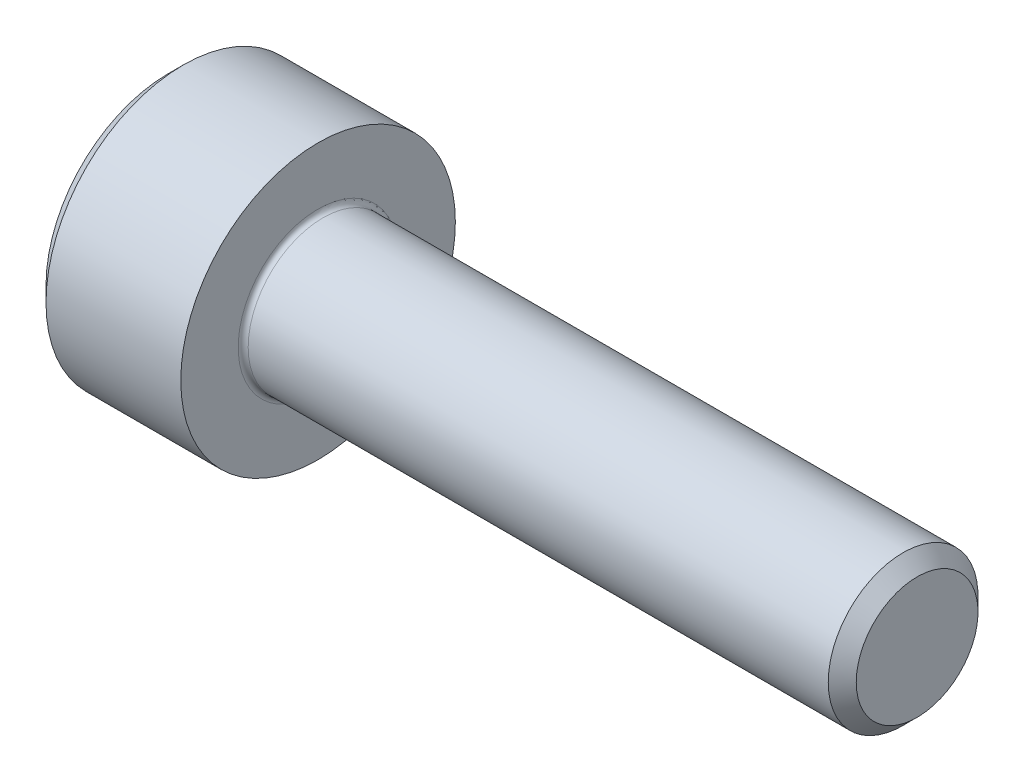
ISO-10303-21;
HEADER;
FILE_DESCRIPTION(('STEP AP214'),'2;1');
FILE_NAME('part.step','',(''),(''),'','','');
FILE_SCHEMA(('AUTOMOTIVE_DESIGN { 1 0 10303 214 1 1 1 1 }'));
ENDSEC;
DATA;
#1=APPLICATION_CONTEXT('core data for automotive mechanical design processes');
#2=APPLICATION_PROTOCOL_DEFINITION('international standard','automotive_design',2000,#1);
#3=PRODUCT_CONTEXT('',#1,'mechanical');
#4=PRODUCT('Part','Part','',(#3));
#5=PRODUCT_RELATED_PRODUCT_CATEGORY('part','',(#4));
#6=PRODUCT_DEFINITION_FORMATION('','',#4);
#7=PRODUCT_DEFINITION_CONTEXT('part definition',#1,'design');
#8=PRODUCT_DEFINITION('design','',#6,#7);
#9=PRODUCT_DEFINITION_SHAPE('','',#8);
#10=(LENGTH_UNIT() NAMED_UNIT(*) SI_UNIT(.MILLI.,.METRE.));
#11=(NAMED_UNIT(*) PLANE_ANGLE_UNIT() SI_UNIT($,.RADIAN.));
#12=(NAMED_UNIT(*) SI_UNIT($,.STERADIAN.) SOLID_ANGLE_UNIT());
#13=UNCERTAINTY_MEASURE_WITH_UNIT(LENGTH_MEASURE(1.E-05),#10,'distance_accuracy_value','');
#14=(GEOMETRIC_REPRESENTATION_CONTEXT(3) GLOBAL_UNCERTAINTY_ASSIGNED_CONTEXT((#13)) GLOBAL_UNIT_ASSIGNED_CONTEXT((#10,
#11,#12)) REPRESENTATION_CONTEXT('',''));
#15=CARTESIAN_POINT('',(0.,0.,0.));
#16=DIRECTION('',(0.,0.,1.));
#17=DIRECTION('',(1.,0.,0.));
#18=AXIS2_PLACEMENT_3D('',#15,#16,#17);
#19=CARTESIAN_POINT('',(0.,0.,0.));
#20=DIRECTION('',(-1.,0.,0.));
#21=DIRECTION('',(0.,0.,1.));
#22=AXIS2_PLACEMENT_3D('',#19,#20,#21);
#23=PLANE('',#22);
#24=DIRECTION('',(0.,-0.5,0.86602540378444));
#25=VECTOR('',#24,1.);
#26=CARTESIAN_POINT('',(0.,1.47801668912544,0.));
#27=LINE('',#26,#25);
#28=CARTESIAN_POINT('',(0.,1.47801668912544,0.));
#29=VERTEX_POINT('',#28);
#30=CARTESIAN_POINT('',(0.,0.73900834456272,1.28));
#31=VERTEX_POINT('',#30);
#32=EDGE_CURVE('E377',#29,#31,#27,.T.);
#33=ORIENTED_EDGE('',*,*,#32,.T.);
#34=DIRECTION('',(0.,1.,0.));
#35=VECTOR('',#34,1.);
#36=CARTESIAN_POINT('',(0.,-0.739008344562722,1.28));
#37=LINE('',#36,#35);
#38=CARTESIAN_POINT('',(0.,-0.739008344562722,1.28));
#39=VERTEX_POINT('',#38);
#40=EDGE_CURVE('E109',#39,#31,#37,.T.);
#41=ORIENTED_EDGE('',*,*,#40,.F.);
#42=DIRECTION('',(0.,-0.5,-0.866025403784438));
#43=VECTOR('',#42,1.);
#44=CARTESIAN_POINT('',(0.,-0.739008344562722,1.28));
#45=LINE('',#44,#43);
#46=CARTESIAN_POINT('',(0.,-1.47801668912544,0.));
#47=VERTEX_POINT('',#46);
#48=EDGE_CURVE('E380',#39,#47,#45,.T.);
#49=ORIENTED_EDGE('',*,*,#48,.T.);
#50=DIRECTION('',(0.,0.5,-0.86602540378444));
#51=VECTOR('',#50,1.);
#52=CARTESIAN_POINT('',(0.,-1.47801668912544,0.));
#53=LINE('',#52,#51);
#54=CARTESIAN_POINT('',(0.,-0.739008344562726,-1.28));
#55=VERTEX_POINT('',#54);
#56=EDGE_CURVE('E383',#47,#55,#53,.T.);
#57=ORIENTED_EDGE('',*,*,#56,.T.);
#58=DIRECTION('',(0.,-1.,0.));
#59=VECTOR('',#58,1.);
#60=CARTESIAN_POINT('',(0.,0.739008344562716,-1.28));
#61=LINE('',#60,#59);
#62=CARTESIAN_POINT('',(0.,0.739008344562716,-1.28));
#63=VERTEX_POINT('',#62);
#64=EDGE_CURVE('E386',#63,#55,#61,.T.);
#65=ORIENTED_EDGE('',*,*,#64,.F.);
#66=DIRECTION('',(0.,-0.5,-0.866025403784438));
#67=VECTOR('',#66,1.);
#68=CARTESIAN_POINT('',(0.,1.47801668912544,0.));
#69=LINE('',#68,#67);
#70=EDGE_CURVE('E104',#29,#63,#69,.T.);
#71=ORIENTED_EDGE('',*,*,#70,.F.);
#72=EDGE_LOOP('',(#33,#41,#49,#57,#65,#71));
#73=FACE_BOUND('',#72,.T.);
#74=CARTESIAN_POINT('',(0.,0.,0.));
#75=DIRECTION('',(-1.,0.,0.));
#76=DIRECTION('',(0.,0.,1.));
#77=AXIS2_PLACEMENT_3D('',#74,#75,#76);
#78=CIRCLE('',#77,2.45);
#79=CARTESIAN_POINT('',(0.,0.,2.45));
#80=VERTEX_POINT('',#79);
#81=EDGE_CURVE('E120',#80,#80,#78,.T.);
#82=ORIENTED_EDGE('',*,*,#81,.T.);
#83=EDGE_LOOP('',(#82));
#84=FACE_BOUND('',#83,.T.);
#85=ADVANCED_FACE('F17',(#73,#84),#23,.T.);
#86=CARTESIAN_POINT('',(15.,1.2195,0.));
#87=DIRECTION('',(1.,0.,0.));
#88=DIRECTION('',(0.,0.,-1.));
#89=AXIS2_PLACEMENT_3D('',#86,#87,#88);
#90=PLANE('',#89);
#91=CARTESIAN_POINT('',(15.,0.,0.));
#92=DIRECTION('',(-1.,0.,0.));
#93=DIRECTION('',(0.,0.,1.));
#94=AXIS2_PLACEMENT_3D('',#91,#92,#93);
#95=CIRCLE('',#94,1.2195);
#96=CARTESIAN_POINT('',(15.,0.,1.2195));
#97=VERTEX_POINT('',#96);
#98=EDGE_CURVE('E133',#97,#97,#95,.T.);
#99=ORIENTED_EDGE('',*,*,#98,.F.);
#100=EDGE_LOOP('',(#99));
#101=FACE_BOUND('',#100,.T.);
#102=ADVANCED_FACE('F155',(#101),#90,.T.);
#103=CARTESIAN_POINT('',(15.,0.,0.));
#104=DIRECTION('',(-1.,0.,0.));
#105=DIRECTION('',(0.,0.,1.));
#106=AXIS2_PLACEMENT_3D('',#103,#104,#105);
#107=CONICAL_SURFACE('',#106,1.2195,0.785398163397391);
#108=CARTESIAN_POINT('',(14.7195,0.,0.));
#109=DIRECTION('',(-1.,0.,0.));
#110=DIRECTION('',(0.,0.,1.));
#111=AXIS2_PLACEMENT_3D('',#108,#109,#110);
#112=CIRCLE('',#111,1.49999999999998);
#113=CARTESIAN_POINT('',(14.7195,0.,1.49999999999998));
#114=VERTEX_POINT('',#113);
#115=EDGE_CURVE('E130',#114,#114,#112,.T.);
#116=ORIENTED_EDGE('',*,*,#115,.F.);
#117=EDGE_LOOP('',(#116));
#118=FACE_BOUND('',#117,.T.);
#119=ORIENTED_EDGE('',*,*,#98,.T.);
#120=EDGE_LOOP('',(#119));
#121=FACE_BOUND('',#120,.T.);
#122=ADVANCED_FACE('F161',(#118,#121),#107,.T.);
#123=CARTESIAN_POINT('',(-31.75,0.,0.));
#124=DIRECTION('',(-1.,0.,0.));
#125=DIRECTION('',(0.,0.,1.));
#126=AXIS2_PLACEMENT_3D('',#123,#124,#125);
#127=CYLINDRICAL_SURFACE('',#126,1.5);
#128=CARTESIAN_POINT('',(3.1,0.,0.));
#129=DIRECTION('',(1.,0.,0.));
#130=DIRECTION('',(0.,0.,-1.));
#131=AXIS2_PLACEMENT_3D('',#128,#129,#130);
#132=CIRCLE('',#131,1.5);
#133=CARTESIAN_POINT('',(3.1,0.,-1.5));
#134=VERTEX_POINT('',#133);
#135=EDGE_CURVE('E11',#134,#134,#132,.T.);
#136=ORIENTED_EDGE('',*,*,#135,.T.);
#137=EDGE_LOOP('',(#136));
#138=FACE_BOUND('',#137,.T.);
#139=ORIENTED_EDGE('',*,*,#115,.T.);
#140=EDGE_LOOP('',(#139));
#141=FACE_BOUND('',#140,.T.);
#142=ADVANCED_FACE('F172',(#138,#141),#127,.T.);
#143=CARTESIAN_POINT('',(3.,2.75,0.));
#144=DIRECTION('',(1.,0.,0.));
#145=DIRECTION('',(0.,0.,-1.));
#146=AXIS2_PLACEMENT_3D('',#143,#144,#145);
#147=PLANE('',#146);
#148=CARTESIAN_POINT('',(3.,0.,0.));
#149=DIRECTION('',(1.,0.,0.));
#150=DIRECTION('',(0.,0.,-1.));
#151=AXIS2_PLACEMENT_3D('',#148,#149,#150);
#152=CIRCLE('',#151,1.6);
#153=CARTESIAN_POINT('',(3.,0.,-1.6));
#154=VERTEX_POINT('',#153);
#155=EDGE_CURVE('E25',#154,#154,#152,.F.);
#156=ORIENTED_EDGE('',*,*,#155,.T.);
#157=EDGE_LOOP('',(#156));
#158=FACE_BOUND('',#157,.T.);
#159=CARTESIAN_POINT('',(3.,0.,0.));
#160=DIRECTION('',(-1.,0.,0.));
#161=DIRECTION('',(0.,0.,1.));
#162=AXIS2_PLACEMENT_3D('',#159,#160,#161);
#163=CIRCLE('',#162,2.75);
#164=CARTESIAN_POINT('',(3.,0.,2.75));
#165=VERTEX_POINT('',#164);
#166=EDGE_CURVE('E127',#165,#165,#163,.T.);
#167=ORIENTED_EDGE('',*,*,#166,.F.);
#168=EDGE_LOOP('',(#167));
#169=FACE_BOUND('',#168,.T.);
#170=ADVANCED_FACE('F138',(#158,#169),#147,.T.);
#171=CARTESIAN_POINT('',(-31.75,0.,0.));
#172=DIRECTION('',(-1.,0.,0.));
#173=DIRECTION('',(0.,0.,1.));
#174=AXIS2_PLACEMENT_3D('',#171,#172,#173);
#175=CYLINDRICAL_SURFACE('',#174,2.75);
#176=ORIENTED_EDGE('',*,*,#166,.T.);
#177=EDGE_LOOP('',(#176));
#178=FACE_BOUND('',#177,.T.);
#179=CARTESIAN_POINT('',(0.3,0.,0.));
#180=DIRECTION('',(-1.,0.,0.));
#181=DIRECTION('',(0.,0.,1.));
#182=AXIS2_PLACEMENT_3D('',#179,#180,#181);
#183=CIRCLE('',#182,2.75);
#184=CARTESIAN_POINT('',(0.3,0.,2.75));
#185=VERTEX_POINT('',#184);
#186=EDGE_CURVE('E124',#185,#185,#183,.T.);
#187=ORIENTED_EDGE('',*,*,#186,.F.);
#188=EDGE_LOOP('',(#187));
#189=FACE_BOUND('',#188,.T.);
#190=ADVANCED_FACE('F150',(#178,#189),#175,.T.);
#191=CARTESIAN_POINT('',(0.,0.,0.));
#192=DIRECTION('',(1.,0.,0.));
#193=DIRECTION('',(0.,0.,-1.));
#194=AXIS2_PLACEMENT_3D('',#191,#192,#193);
#195=CONICAL_SURFACE('',#194,2.45,0.785398163397439);
#196=ORIENTED_EDGE('',*,*,#186,.T.);
#197=EDGE_LOOP('',(#196));
#198=FACE_BOUND('',#197,.T.);
#199=ORIENTED_EDGE('',*,*,#81,.F.);
#200=EDGE_LOOP('',(#199));
#201=FACE_BOUND('',#200,.T.);
#202=ADVANCED_FACE('F142',(#198,#201),#195,.T.);
#203=CARTESIAN_POINT('',(3.1,0.,0.));
#204=DIRECTION('',(1.,0.,0.));
#205=DIRECTION('',(0.,0.,-1.));
#206=AXIS2_PLACEMENT_3D('',#203,#204,#205);
#207=TOROIDAL_SURFACE('',#206,1.6,0.1);
#208=ORIENTED_EDGE('',*,*,#135,.F.);
#209=EDGE_LOOP('',(#208));
#210=FACE_BOUND('',#209,.T.);
#211=ORIENTED_EDGE('',*,*,#155,.F.);
#212=EDGE_LOOP('',(#211));
#213=FACE_BOUND('',#212,.T.);
#214=ADVANCED_FACE('F19',(#210,#213),#207,.F.);
#215=CARTESIAN_POINT('',(1.3,1.47801668912544,0.));
#216=DIRECTION('',(0.,-0.86602540378444,-0.5));
#217=DIRECTION('',(0.,0.5,-0.86602540378444));
#218=AXIS2_PLACEMENT_3D('',#215,#216,#217);
#219=PLANE('',#218);
#220=ORIENTED_EDGE('',*,*,#32,.F.);
#221=DIRECTION('',(-1.,0.,0.));
#222=VECTOR('',#221,1.);
#223=CARTESIAN_POINT('',(1.3,1.47801668912544,0.));
#224=LINE('',#223,#222);
#225=CARTESIAN_POINT('',(1.3,1.47801668912544,0.));
#226=VERTEX_POINT('',#225);
#227=EDGE_CURVE('E376',#226,#29,#224,.T.);
#228=ORIENTED_EDGE('',*,*,#227,.F.);
#229=DIRECTION('',(0.,-0.5,0.86602540378444));
#230=VECTOR('',#229,1.);
#231=CARTESIAN_POINT('',(1.3,1.47801668912544,0.));
#232=LINE('',#231,#230);
#233=CARTESIAN_POINT('',(1.3,1.10851251684408,0.64));
#234=VERTEX_POINT('',#233);
#235=EDGE_CURVE('E32',#226,#234,#232,.T.);
#236=ORIENTED_EDGE('',*,*,#235,.T.);
#237=CARTESIAN_POINT('',(1.3,0.73900834456272,1.28));
#238=VERTEX_POINT('',#237);
#239=EDGE_CURVE('E90',#234,#238,#232,.T.);
#240=ORIENTED_EDGE('',*,*,#239,.T.);
#241=DIRECTION('',(-1.,0.,0.));
#242=VECTOR('',#241,1.);
#243=CARTESIAN_POINT('',(1.3,0.73900834456272,1.28));
#244=LINE('',#243,#242);
#245=EDGE_CURVE('E102',#238,#31,#244,.T.);
#246=ORIENTED_EDGE('',*,*,#245,.T.);
#247=EDGE_LOOP('',(#220,#228,#236,#240,#246));
#248=FACE_BOUND('',#247,.T.);
#249=ADVANCED_FACE('F101',(#248),#219,.T.);
#250=CARTESIAN_POINT('',(1.3,-0.739008344562722,1.28));
#251=DIRECTION('',(0.,0.,1.));
#252=DIRECTION('',(0.,-1.,0.));
#253=AXIS2_PLACEMENT_3D('',#250,#251,#252);
#254=PLANE('',#253);
#255=ORIENTED_EDGE('',*,*,#40,.T.);
#256=ORIENTED_EDGE('',*,*,#245,.F.);
#257=DIRECTION('',(0.,1.,0.));
#258=VECTOR('',#257,1.);
#259=CARTESIAN_POINT('',(1.3,-0.739008344562722,1.28));
#260=LINE('',#259,#258);
#261=CARTESIAN_POINT('',(1.3,0.,1.28));
#262=VERTEX_POINT('',#261);
#263=EDGE_CURVE('E88',#262,#238,#260,.T.);
#264=ORIENTED_EDGE('',*,*,#263,.F.);
#265=CARTESIAN_POINT('',(1.3,-0.739008344562722,1.28));
#266=VERTEX_POINT('',#265);
#267=EDGE_CURVE('E98',#266,#262,#260,.T.);
#268=ORIENTED_EDGE('',*,*,#267,.F.);
#269=DIRECTION('',(-1.,0.,0.));
#270=VECTOR('',#269,1.);
#271=CARTESIAN_POINT('',(1.3,-0.739008344562722,1.28));
#272=LINE('',#271,#270);
#273=EDGE_CURVE('E111',#266,#39,#272,.T.);
#274=ORIENTED_EDGE('',*,*,#273,.T.);
#275=EDGE_LOOP('',(#255,#256,#264,#268,#274));
#276=FACE_BOUND('',#275,.T.);
#277=ADVANCED_FACE('F106',(#276),#254,.F.);
#278=CARTESIAN_POINT('',(1.3,-0.739008344562722,1.28));
#279=DIRECTION('',(0.,0.866025403784438,-0.5));
#280=DIRECTION('',(0.,0.5,0.866025403784438));
#281=AXIS2_PLACEMENT_3D('',#278,#279,#280);
#282=PLANE('',#281);
#283=ORIENTED_EDGE('',*,*,#48,.F.);
#284=ORIENTED_EDGE('',*,*,#273,.F.);
#285=DIRECTION('',(0.,-0.5,-0.866025403784438));
#286=VECTOR('',#285,1.);
#287=CARTESIAN_POINT('',(1.3,-0.739008344562722,1.28));
#288=LINE('',#287,#286);
#289=CARTESIAN_POINT('',(1.3,-1.10851251684408,0.64));
#290=VERTEX_POINT('',#289);
#291=EDGE_CURVE('E355',#266,#290,#288,.T.);
#292=ORIENTED_EDGE('',*,*,#291,.T.);
#293=CARTESIAN_POINT('',(1.3,-1.47801668912544,0.));
#294=VERTEX_POINT('',#293);
#295=EDGE_CURVE('E357',#290,#294,#288,.T.);
#296=ORIENTED_EDGE('',*,*,#295,.T.);
#297=DIRECTION('',(-1.,0.,0.));
#298=VECTOR('',#297,1.);
#299=CARTESIAN_POINT('',(1.3,-1.47801668912544,0.));
#300=LINE('',#299,#298);
#301=EDGE_CURVE('E116',#294,#47,#300,.T.);
#302=ORIENTED_EDGE('',*,*,#301,.T.);
#303=EDGE_LOOP('',(#283,#284,#292,#296,#302));
#304=FACE_BOUND('',#303,.T.);
#305=ADVANCED_FACE('F232',(#304),#282,.T.);
#306=CARTESIAN_POINT('',(1.3,-1.47801668912544,0.));
#307=DIRECTION('',(0.,0.86602540378444,0.5));
#308=DIRECTION('',(0.,-0.5,0.86602540378444));
#309=AXIS2_PLACEMENT_3D('',#306,#307,#308);
#310=PLANE('',#309);
#311=ORIENTED_EDGE('',*,*,#56,.F.);
#312=ORIENTED_EDGE('',*,*,#301,.F.);
#313=DIRECTION('',(0.,0.5,-0.86602540378444));
#314=VECTOR('',#313,1.);
#315=CARTESIAN_POINT('',(1.3,-1.47801668912544,0.));
#316=LINE('',#315,#314);
#317=CARTESIAN_POINT('',(1.3,-1.10851251684409,-0.64));
#318=VERTEX_POINT('',#317);
#319=EDGE_CURVE('E360',#294,#318,#316,.T.);
#320=ORIENTED_EDGE('',*,*,#319,.T.);
#321=CARTESIAN_POINT('',(1.3,-0.739008344562726,-1.28));
#322=VERTEX_POINT('',#321);
#323=EDGE_CURVE('E364',#318,#322,#316,.T.);
#324=ORIENTED_EDGE('',*,*,#323,.T.);
#325=DIRECTION('',(-1.,0.,0.));
#326=VECTOR('',#325,1.);
#327=CARTESIAN_POINT('',(1.3,-0.739008344562726,-1.28));
#328=LINE('',#327,#326);
#329=EDGE_CURVE('E395',#322,#55,#328,.T.);
#330=ORIENTED_EDGE('',*,*,#329,.T.);
#331=EDGE_LOOP('',(#311,#312,#320,#324,#330));
#332=FACE_BOUND('',#331,.T.);
#333=ADVANCED_FACE('F242',(#332),#310,.T.);
#334=CARTESIAN_POINT('',(1.3,0.739008344562716,-1.28));
#335=DIRECTION('',(0.,0.,-1.));
#336=DIRECTION('',(0.,1.,0.));
#337=AXIS2_PLACEMENT_3D('',#334,#335,#336);
#338=PLANE('',#337);
#339=ORIENTED_EDGE('',*,*,#64,.T.);
#340=ORIENTED_EDGE('',*,*,#329,.F.);
#341=DIRECTION('',(0.,-1.,0.));
#342=VECTOR('',#341,1.);
#343=CARTESIAN_POINT('',(1.3,0.739008344562716,-1.28));
#344=LINE('',#343,#342);
#345=CARTESIAN_POINT('',(1.3,0.,-1.28));
#346=VERTEX_POINT('',#345);
#347=EDGE_CURVE('E368',#346,#322,#344,.T.);
#348=ORIENTED_EDGE('',*,*,#347,.F.);
#349=CARTESIAN_POINT('',(1.3,0.739008344562716,-1.28));
#350=VERTEX_POINT('',#349);
#351=EDGE_CURVE('E369',#350,#346,#344,.T.);
#352=ORIENTED_EDGE('',*,*,#351,.F.);
#353=DIRECTION('',(-1.,0.,0.));
#354=VECTOR('',#353,1.);
#355=CARTESIAN_POINT('',(1.3,0.739008344562716,-1.28));
#356=LINE('',#355,#354);
#357=EDGE_CURVE('E392',#350,#63,#356,.T.);
#358=ORIENTED_EDGE('',*,*,#357,.T.);
#359=EDGE_LOOP('',(#339,#340,#348,#352,#358));
#360=FACE_BOUND('',#359,.T.);
#361=ADVANCED_FACE('F252',(#360),#338,.F.);
#362=CARTESIAN_POINT('',(1.3,1.47801668912544,0.));
#363=DIRECTION('',(0.,0.866025403784438,-0.5));
#364=DIRECTION('',(0.,0.5,0.866025403784438));
#365=AXIS2_PLACEMENT_3D('',#362,#363,#364);
#366=PLANE('',#365);
#367=ORIENTED_EDGE('',*,*,#70,.T.);
#368=ORIENTED_EDGE('',*,*,#357,.F.);
#369=DIRECTION('',(0.,-0.5,-0.866025403784438));
#370=VECTOR('',#369,1.);
#371=CARTESIAN_POINT('',(1.3,1.47801668912544,0.));
#372=LINE('',#371,#370);
#373=CARTESIAN_POINT('',(1.3,1.10851251684408,-0.64));
#374=VERTEX_POINT('',#373);
#375=EDGE_CURVE('E372',#374,#350,#372,.T.);
#376=ORIENTED_EDGE('',*,*,#375,.F.);
#377=EDGE_CURVE('E373',#226,#374,#372,.T.);
#378=ORIENTED_EDGE('',*,*,#377,.F.);
#379=ORIENTED_EDGE('',*,*,#227,.T.);
#380=EDGE_LOOP('',(#367,#368,#376,#378,#379));
#381=FACE_BOUND('',#380,.T.);
#382=ADVANCED_FACE('F262',(#381),#366,.F.);
#383=CARTESIAN_POINT('',(1.3,0.73900834456272,1.28));
#384=DIRECTION('',(-1.,0.,0.));
#385=DIRECTION('',(0.,0.,1.));
#386=AXIS2_PLACEMENT_3D('',#383,#384,#385);
#387=PLANE('',#386);
#388=CARTESIAN_POINT('',(1.3,0.,0.));
#389=DIRECTION('',(-1.,0.,0.));
#390=DIRECTION('',(0.,0.,1.));
#391=AXIS2_PLACEMENT_3D('',#388,#389,#390);
#392=CIRCLE('',#391,1.28);
#393=EDGE_CURVE('E110',#290,#262,#392,.T.);
#394=ORIENTED_EDGE('',*,*,#393,.F.);
#395=ORIENTED_EDGE('',*,*,#291,.F.);
#396=ORIENTED_EDGE('',*,*,#267,.T.);
#397=EDGE_LOOP('',(#394,#395,#396));
#398=FACE_BOUND('',#397,.T.);
#399=ADVANCED_FACE('F272',(#398),#387,.T.);
#400=EDGE_CURVE('E114',#318,#290,#392,.T.);
#401=ORIENTED_EDGE('',*,*,#400,.F.);
#402=ORIENTED_EDGE('',*,*,#319,.F.);
#403=ORIENTED_EDGE('',*,*,#295,.F.);
#404=EDGE_LOOP('',(#401,#402,#403));
#405=FACE_BOUND('',#404,.T.);
#406=ADVANCED_FACE('F282',(#405),#387,.T.);
#407=EDGE_CURVE('E403',#346,#318,#392,.T.);
#408=ORIENTED_EDGE('',*,*,#407,.F.);
#409=ORIENTED_EDGE('',*,*,#347,.T.);
#410=ORIENTED_EDGE('',*,*,#323,.F.);
#411=EDGE_LOOP('',(#408,#409,#410));
#412=FACE_BOUND('',#411,.T.);
#413=ADVANCED_FACE('F292',(#412),#387,.T.);
#414=EDGE_CURVE('E402',#374,#346,#392,.T.);
#415=ORIENTED_EDGE('',*,*,#414,.F.);
#416=ORIENTED_EDGE('',*,*,#375,.T.);
#417=ORIENTED_EDGE('',*,*,#351,.T.);
#418=EDGE_LOOP('',(#415,#416,#417));
#419=FACE_BOUND('',#418,.T.);
#420=ADVANCED_FACE('F301',(#419),#387,.T.);
#421=EDGE_CURVE('E121',#234,#374,#392,.T.);
#422=ORIENTED_EDGE('',*,*,#421,.F.);
#423=ORIENTED_EDGE('',*,*,#235,.F.);
#424=ORIENTED_EDGE('',*,*,#377,.T.);
#425=EDGE_LOOP('',(#422,#423,#424));
#426=FACE_BOUND('',#425,.T.);
#427=ADVANCED_FACE('F310',(#426),#387,.T.);
#428=EDGE_CURVE('E93',#262,#234,#392,.T.);
#429=ORIENTED_EDGE('',*,*,#428,.F.);
#430=ORIENTED_EDGE('',*,*,#263,.T.);
#431=ORIENTED_EDGE('',*,*,#239,.F.);
#432=EDGE_LOOP('',(#429,#430,#431));
#433=FACE_BOUND('',#432,.T.);
#434=ADVANCED_FACE('F89',(#433),#387,.T.);
#435=CARTESIAN_POINT('',(1.3,0.,0.));
#436=DIRECTION('',(-1.,0.,0.));
#437=DIRECTION('',(0.,0.,1.));
#438=AXIS2_PLACEMENT_3D('',#435,#436,#437);
#439=CONICAL_SURFACE('',#438,1.28,1.0471975511966);
#440=CARTESIAN_POINT('',(2.03900834456273,0.,0.));
#441=VERTEX_POINT('',#440);
#442=VERTEX_LOOP('',#441);
#443=FACE_BOUND('',#442,.T.);
#444=ORIENTED_EDGE('',*,*,#428,.T.);
#445=ORIENTED_EDGE('',*,*,#421,.T.);
#446=ORIENTED_EDGE('',*,*,#414,.T.);
#447=ORIENTED_EDGE('',*,*,#407,.T.);
#448=ORIENTED_EDGE('',*,*,#400,.T.);
#449=ORIENTED_EDGE('',*,*,#393,.T.);
#450=EDGE_LOOP('',(#444,#445,#446,#447,#448,#449));
#451=FACE_BOUND('',#450,.T.);
#452=ADVANCED_FACE('F165',(#443,#451),#439,.F.);
#453=CLOSED_SHELL('',(#85,#102,#122,#142,#170,#190,#202,#214,#249,#277,#305,#333,#361,#382,#399,
#406,#413,#420,#427,#434,#452));
#454=MANIFOLD_SOLID_BREP('B1',#453);
#455=ADVANCED_BREP_SHAPE_REPRESENTATION('',(#18,#454),#14);
#456=SHAPE_DEFINITION_REPRESENTATION(#9,#455);
ENDSEC;
END-ISO-10303-21;
